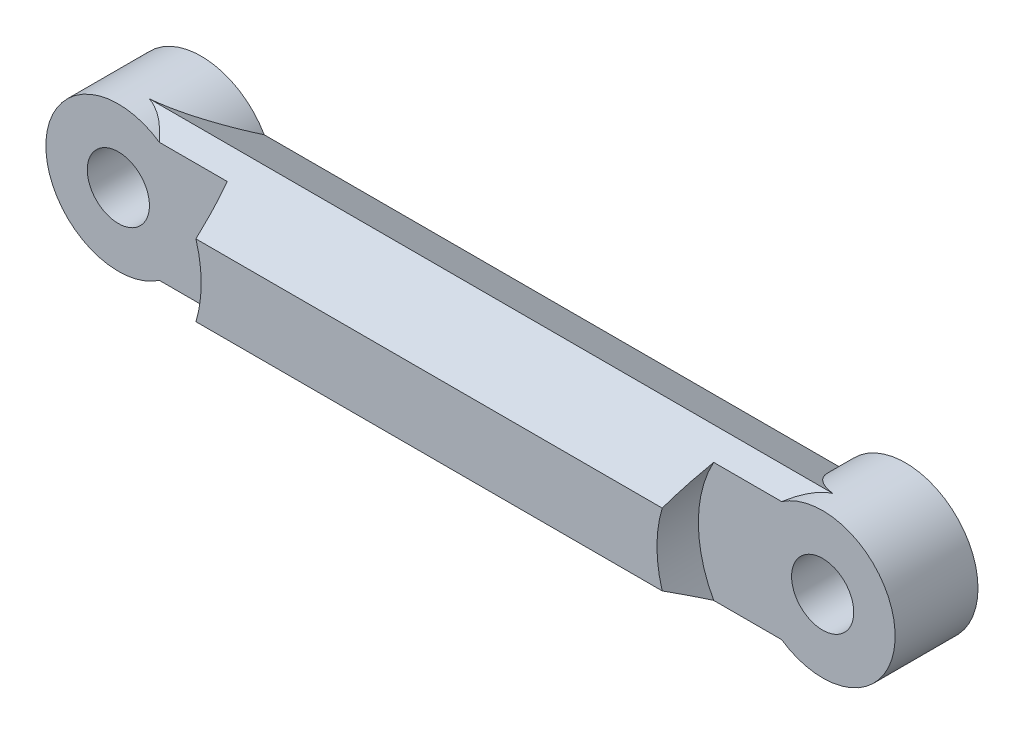
ISO-10303-21;
HEADER;
FILE_DESCRIPTION(('STEP AP214'),'2;1');
FILE_NAME('part.step','',(''),(''),'','','');
FILE_SCHEMA(('AUTOMOTIVE_DESIGN { 1 0 10303 214 1 1 1 1 }'));
ENDSEC;
DATA;
#1=APPLICATION_CONTEXT('core data for automotive mechanical design processes');
#2=APPLICATION_PROTOCOL_DEFINITION('international standard','automotive_design',2000,#1);
#3=PRODUCT_CONTEXT('',#1,'mechanical');
#4=PRODUCT('Part','Part','',(#3));
#5=PRODUCT_RELATED_PRODUCT_CATEGORY('part','',(#4));
#6=PRODUCT_DEFINITION_FORMATION('','',#4);
#7=PRODUCT_DEFINITION_CONTEXT('part definition',#1,'design');
#8=PRODUCT_DEFINITION('design','',#6,#7);
#9=PRODUCT_DEFINITION_SHAPE('','',#8);
#10=(LENGTH_UNIT() NAMED_UNIT(*) SI_UNIT(.MILLI.,.METRE.));
#11=(NAMED_UNIT(*) PLANE_ANGLE_UNIT() SI_UNIT($,.RADIAN.));
#12=(NAMED_UNIT(*) SI_UNIT($,.STERADIAN.) SOLID_ANGLE_UNIT());
#13=UNCERTAINTY_MEASURE_WITH_UNIT(LENGTH_MEASURE(1.E-05),#10,'distance_accuracy_value','');
#14=(GEOMETRIC_REPRESENTATION_CONTEXT(3) GLOBAL_UNCERTAINTY_ASSIGNED_CONTEXT((#13)) GLOBAL_UNIT_ASSIGNED_CONTEXT((#10,
#11,#12)) REPRESENTATION_CONTEXT('',''));
#15=CARTESIAN_POINT('',(0.,0.,0.));
#16=DIRECTION('',(0.,0.,1.));
#17=DIRECTION('',(1.,0.,0.));
#18=AXIS2_PLACEMENT_3D('',#15,#16,#17);
#19=CARTESIAN_POINT('',(-17.,0.,3.));
#20=DIRECTION('',(0.,0.,-1.));
#21=DIRECTION('',(-1.,0.,0.));
#22=AXIS2_PLACEMENT_3D('',#19,#20,#21);
#23=CYLINDRICAL_SURFACE('',#22,3.5);
#24=CARTESIAN_POINT('',(-17.,0.,1.));
#25=DIRECTION('',(0.,0.,1.));
#26=DIRECTION('',(1.,0.,0.));
#27=AXIS2_PLACEMENT_3D('',#24,#25,#26);
#28=CIRCLE('',#27,3.5);
#29=CARTESIAN_POINT('',(-15.0209429854937,2.88675134594813,1.));
#30=VERTEX_POINT('',#29);
#31=CARTESIAN_POINT('',(-15.0209429854937,-2.88675134594813,1.));
#32=VERTEX_POINT('',#31);
#33=EDGE_CURVE('E129',#30,#32,#28,.T.);
#34=ORIENTED_EDGE('',*,*,#33,.F.);
#35=CARTESIAN_POINT('',(-17.,0.,6.));
#36=DIRECTION('',(0.,0.866025403784439,0.5));
#37=DIRECTION('',(0.,0.5,-0.866025403784439));
#38=AXIS2_PLACEMENT_3D('',#35,#36,#37);
#39=ELLIPSE('',#38,7.,3.5);
#40=CARTESIAN_POINT('',(-16.5,3.46410161513775,0.));
#41=VERTEX_POINT('',#40);
#42=EDGE_CURVE('E162',#41,#30,#39,.F.);
#43=ORIENTED_EDGE('',*,*,#42,.F.);
#44=CARTESIAN_POINT('',(-17.,0.,-6.));
#45=DIRECTION('',(0.,0.866025403784439,-0.5));
#46=DIRECTION('',(0.,-0.5,-0.866025403784439));
#47=AXIS2_PLACEMENT_3D('',#44,#45,#46);
#48=ELLIPSE('',#47,7.,3.5);
#49=CARTESIAN_POINT('',(-13.9586187348509,1.73205080756888,-3.));
#50=VERTEX_POINT('',#49);
#51=EDGE_CURVE('E197',#50,#41,#48,.F.);
#52=ORIENTED_EDGE('',*,*,#51,.F.);
#53=CARTESIAN_POINT('',(-17.,0.,-3.));
#54=DIRECTION('',(0.,0.,1.));
#55=DIRECTION('',(1.,0.,0.));
#56=AXIS2_PLACEMENT_3D('',#53,#54,#55);
#57=CIRCLE('',#56,3.5);
#58=CARTESIAN_POINT('',(-13.9586187348509,-1.73205080756888,-3.));
#59=VERTEX_POINT('',#58);
#60=EDGE_CURVE('E147',#50,#59,#57,.T.);
#61=ORIENTED_EDGE('',*,*,#60,.T.);
#62=CARTESIAN_POINT('',(-17.,0.,-6.));
#63=DIRECTION('',(0.,-0.866025403784439,-0.5));
#64=DIRECTION('',(0.,0.5,-0.866025403784439));
#65=AXIS2_PLACEMENT_3D('',#62,#63,#64);
#66=ELLIPSE('',#65,7.,3.5);
#67=CARTESIAN_POINT('',(-16.5,-3.46410161513775,0.));
#68=VERTEX_POINT('',#67);
#69=EDGE_CURVE('E204',#68,#59,#66,.F.);
#70=ORIENTED_EDGE('',*,*,#69,.F.);
#71=CARTESIAN_POINT('',(-17.,0.,6.));
#72=DIRECTION('',(0.,-0.866025403784439,0.5));
#73=DIRECTION('',(0.,-0.5,-0.866025403784439));
#74=AXIS2_PLACEMENT_3D('',#71,#72,#73);
#75=ELLIPSE('',#74,7.,3.5);
#76=EDGE_CURVE('E134',#32,#68,#75,.F.);
#77=ORIENTED_EDGE('',*,*,#76,.F.);
#78=EDGE_LOOP('',(#34,#43,#52,#61,#70,#77));
#79=FACE_BOUND('',#78,.T.);
#80=ADVANCED_FACE('F35',(#79),#23,.T.);
#81=CARTESIAN_POINT('',(-17.,0.,3.));
#82=DIRECTION('',(0.,0.,-1.));
#83=DIRECTION('',(-1.,0.,0.));
#84=AXIS2_PLACEMENT_3D('',#81,#82,#83);
#85=CYLINDRICAL_SURFACE('',#84,1.5);
#86=CARTESIAN_POINT('',(-17.,0.,-3.));
#87=DIRECTION('',(0.,0.,1.));
#88=DIRECTION('',(1.,0.,0.));
#89=AXIS2_PLACEMENT_3D('',#86,#87,#88);
#90=CIRCLE('',#89,1.5);
#91=CARTESIAN_POINT('',(-15.5,0.,-3.));
#92=VERTEX_POINT('',#91);
#93=EDGE_CURVE('E144',#92,#92,#90,.T.);
#94=ORIENTED_EDGE('',*,*,#93,.F.);
#95=EDGE_LOOP('',(#94));
#96=FACE_BOUND('',#95,.T.);
#97=CARTESIAN_POINT('',(-17.,0.,1.));
#98=DIRECTION('',(0.,0.,1.));
#99=DIRECTION('',(1.,0.,0.));
#100=AXIS2_PLACEMENT_3D('',#97,#98,#99);
#101=CIRCLE('',#100,1.5);
#102=CARTESIAN_POINT('',(-15.5,0.,1.));
#103=VERTEX_POINT('',#102);
#104=EDGE_CURVE('E172',#103,#103,#101,.T.);
#105=ORIENTED_EDGE('',*,*,#104,.T.);
#106=EDGE_LOOP('',(#105));
#107=FACE_BOUND('',#106,.T.);
#108=ADVANCED_FACE('F241',(#96,#107),#85,.F.);
#109=CARTESIAN_POINT('',(-17.,0.,3.));
#110=DIRECTION('',(0.,0.,1.));
#111=DIRECTION('',(1.,0.,0.));
#112=AXIS2_PLACEMENT_3D('',#109,#110,#111);
#113=PLANE('',#112);
#114=CARTESIAN_POINT('',(-17.,0.,3.));
#115=DIRECTION('',(0.,0.,1.));
#116=DIRECTION('',(1.,0.,0.));
#117=AXIS2_PLACEMENT_3D('',#114,#115,#116);
#118=CIRCLE('',#117,6.);
#119=CARTESIAN_POINT('',(-11.255437353462,-1.73205080756888,3.));
#120=VERTEX_POINT('',#119);
#121=CARTESIAN_POINT('',(-11.255437353462,1.73205080756888,3.));
#122=VERTEX_POINT('',#121);
#123=EDGE_CURVE('E133',#120,#122,#118,.T.);
#124=ORIENTED_EDGE('',*,*,#123,.F.);
#125=DIRECTION('',(1.,0.,0.));
#126=VECTOR('',#125,1.);
#127=CARTESIAN_POINT('',(-20.501,-1.73205080756888,3.));
#128=LINE('',#127,#126);
#129=CARTESIAN_POINT('',(11.255437353462,-1.73205080756888,3.));
#130=VERTEX_POINT('',#129);
#131=EDGE_CURVE('E127',#120,#130,#128,.T.);
#132=ORIENTED_EDGE('',*,*,#131,.T.);
#133=CARTESIAN_POINT('',(17.,0.,3.));
#134=DIRECTION('',(0.,0.,1.));
#135=DIRECTION('',(-1.,0.,0.));
#136=AXIS2_PLACEMENT_3D('',#133,#134,#135);
#137=CIRCLE('',#136,6.);
#138=CARTESIAN_POINT('',(11.255437353462,1.73205080756888,3.));
#139=VERTEX_POINT('',#138);
#140=EDGE_CURVE('E110',#139,#130,#137,.T.);
#141=ORIENTED_EDGE('',*,*,#140,.F.);
#142=DIRECTION('',(1.,0.,0.));
#143=VECTOR('',#142,1.);
#144=CARTESIAN_POINT('',(-20.501,1.73205080756888,3.));
#145=LINE('',#144,#143);
#146=EDGE_CURVE('E148',#122,#139,#145,.T.);
#147=ORIENTED_EDGE('',*,*,#146,.F.);
#148=EDGE_LOOP('',(#124,#132,#141,#147));
#149=FACE_BOUND('',#148,.T.);
#150=ADVANCED_FACE('F132',(#149),#113,.T.);
#151=CARTESIAN_POINT('',(-17.,0.,-3.));
#152=DIRECTION('',(0.,0.,1.));
#153=DIRECTION('',(1.,0.,0.));
#154=AXIS2_PLACEMENT_3D('',#151,#152,#153);
#155=PLANE('',#154);
#156=ORIENTED_EDGE('',*,*,#60,.F.);
#157=DIRECTION('',(1.,0.,0.));
#158=VECTOR('',#157,1.);
#159=CARTESIAN_POINT('',(-20.501,1.73205080756888,-3.));
#160=LINE('',#159,#158);
#161=CARTESIAN_POINT('',(13.9586187348509,1.73205080756888,-3.));
#162=VERTEX_POINT('',#161);
#163=EDGE_CURVE('E199',#50,#162,#160,.T.);
#164=ORIENTED_EDGE('',*,*,#163,.T.);
#165=CARTESIAN_POINT('',(17.,0.,-3.));
#166=DIRECTION('',(0.,0.,1.));
#167=DIRECTION('',(1.,0.,0.));
#168=AXIS2_PLACEMENT_3D('',#165,#166,#167);
#169=CIRCLE('',#168,3.5);
#170=CARTESIAN_POINT('',(13.9586187348509,-1.73205080756888,-3.));
#171=VERTEX_POINT('',#170);
#172=EDGE_CURVE('E183',#171,#162,#169,.T.);
#173=ORIENTED_EDGE('',*,*,#172,.F.);
#174=DIRECTION('',(1.,0.,0.));
#175=VECTOR('',#174,1.);
#176=CARTESIAN_POINT('',(-20.501,-1.73205080756888,-3.));
#177=LINE('',#176,#175);
#178=EDGE_CURVE('E202',#59,#171,#177,.T.);
#179=ORIENTED_EDGE('',*,*,#178,.F.);
#180=EDGE_LOOP('',(#156,#164,#173,#179));
#181=FACE_BOUND('',#180,.T.);
#182=ORIENTED_EDGE('',*,*,#93,.T.);
#183=EDGE_LOOP('',(#182));
#184=FACE_BOUND('',#183,.T.);
#185=CARTESIAN_POINT('',(17.,0.,-3.));
#186=DIRECTION('',(0.,0.,1.));
#187=DIRECTION('',(1.,0.,0.));
#188=AXIS2_PLACEMENT_3D('',#185,#186,#187);
#189=CIRCLE('',#188,1.5);
#190=CARTESIAN_POINT('',(18.5,0.,-3.));
#191=VERTEX_POINT('',#190);
#192=EDGE_CURVE('E180',#191,#191,#189,.T.);
#193=ORIENTED_EDGE('',*,*,#192,.T.);
#194=EDGE_LOOP('',(#193));
#195=FACE_BOUND('',#194,.T.);
#196=ADVANCED_FACE('F216',(#181,#184,#195),#155,.F.);
#197=CARTESIAN_POINT('',(-20.501,-1.73205080756888,3.));
#198=DIRECTION('',(0.,-0.866025403784439,0.5));
#199=DIRECTION('',(0.,-0.5,-0.866025403784439));
#200=AXIS2_PLACEMENT_3D('',#197,#198,#199);
#201=PLANE('',#200);
#202=CARTESIAN_POINT('',(-17.,0.,6.));
#203=DIRECTION('',(0.,-0.866025403784439,0.5));
#204=DIRECTION('',(0.,0.5,0.866025403784439));
#205=AXIS2_PLACEMENT_3D('',#202,#203,#204);
#206=ELLIPSE('',#205,12.,6.);
#207=CARTESIAN_POINT('',(-11.7400887206468,-2.88675134594813,1.));
#208=VERTEX_POINT('',#207);
#209=EDGE_CURVE('E178',#208,#120,#206,.T.);
#210=ORIENTED_EDGE('',*,*,#209,.F.);
#211=DIRECTION('',(-1.,0.,0.));
#212=VECTOR('',#211,1.);
#213=CARTESIAN_POINT('',(-20.501,-2.88675134594813,1.));
#214=LINE('',#213,#212);
#215=EDGE_CURVE('E170',#208,#32,#214,.T.);
#216=ORIENTED_EDGE('',*,*,#215,.T.);
#217=ORIENTED_EDGE('',*,*,#76,.T.);
#218=DIRECTION('',(1.,0.,0.));
#219=VECTOR('',#218,1.);
#220=CARTESIAN_POINT('',(-20.501,-3.46410161513775,0.));
#221=LINE('',#220,#219);
#222=CARTESIAN_POINT('',(16.5,-3.46410161513775,0.));
#223=VERTEX_POINT('',#222);
#224=EDGE_CURVE('E137',#68,#223,#221,.T.);
#225=ORIENTED_EDGE('',*,*,#224,.T.);
#226=CARTESIAN_POINT('',(17.,0.,6.));
#227=DIRECTION('',(0.,0.866025403784438,-0.5));
#228=DIRECTION('',(0.,-0.5,-0.866025403784439));
#229=AXIS2_PLACEMENT_3D('',#226,#227,#228);
#230=ELLIPSE('',#229,7.00000000000001,3.5);
#231=CARTESIAN_POINT('',(15.0209429854937,-2.88675134594813,1.));
#232=VERTEX_POINT('',#231);
#233=EDGE_CURVE('E185',#232,#223,#230,.F.);
#234=ORIENTED_EDGE('',*,*,#233,.F.);
#235=DIRECTION('',(1.,0.,0.));
#236=VECTOR('',#235,1.);
#237=CARTESIAN_POINT('',(-20.501,-2.88675134594813,1.));
#238=LINE('',#237,#236);
#239=CARTESIAN_POINT('',(11.7400887206468,-2.88675134594813,1.));
#240=VERTEX_POINT('',#239);
#241=EDGE_CURVE('E56',#240,#232,#238,.T.);
#242=ORIENTED_EDGE('',*,*,#241,.F.);
#243=CARTESIAN_POINT('',(17.,0.,6.));
#244=DIRECTION('',(0.,-0.866025403784439,0.5));
#245=DIRECTION('',(0.,0.5,0.866025403784439));
#246=AXIS2_PLACEMENT_3D('',#243,#244,#245);
#247=ELLIPSE('',#246,12.,6.);
#248=EDGE_CURVE('E114',#130,#240,#247,.T.);
#249=ORIENTED_EDGE('',*,*,#248,.F.);
#250=ORIENTED_EDGE('',*,*,#131,.F.);
#251=EDGE_LOOP('',(#210,#216,#217,#225,#234,#242,#249,#250));
#252=FACE_BOUND('',#251,.T.);
#253=ADVANCED_FACE('F126',(#252),#201,.T.);
#254=CARTESIAN_POINT('',(-20.501,-3.46410161513775,0.));
#255=DIRECTION('',(0.,-0.866025403784439,-0.5));
#256=DIRECTION('',(0.,0.5,-0.866025403784439));
#257=AXIS2_PLACEMENT_3D('',#254,#255,#256);
#258=PLANE('',#257);
#259=ORIENTED_EDGE('',*,*,#224,.F.);
#260=ORIENTED_EDGE('',*,*,#69,.T.);
#261=ORIENTED_EDGE('',*,*,#178,.T.);
#262=CARTESIAN_POINT('',(17.,0.,-6.));
#263=DIRECTION('',(0.,0.866025403784438,0.5));
#264=DIRECTION('',(0.,0.5,-0.866025403784439));
#265=AXIS2_PLACEMENT_3D('',#262,#263,#264);
#266=ELLIPSE('',#265,7.00000000000001,3.5);
#267=EDGE_CURVE('E188',#223,#171,#266,.F.);
#268=ORIENTED_EDGE('',*,*,#267,.F.);
#269=EDGE_LOOP('',(#259,#260,#261,#268));
#270=FACE_BOUND('',#269,.T.);
#271=ADVANCED_FACE('F210',(#270),#258,.T.);
#272=CARTESIAN_POINT('',(-20.501,1.73205080756888,-3.));
#273=DIRECTION('',(0.,0.866025403784439,-0.5));
#274=DIRECTION('',(0.,0.5,0.866025403784439));
#275=AXIS2_PLACEMENT_3D('',#272,#273,#274);
#276=PLANE('',#275);
#277=ORIENTED_EDGE('',*,*,#163,.F.);
#278=ORIENTED_EDGE('',*,*,#51,.T.);
#279=DIRECTION('',(1.,0.,0.));
#280=VECTOR('',#279,1.);
#281=CARTESIAN_POINT('',(-20.501,3.46410161513775,0.));
#282=LINE('',#281,#280);
#283=CARTESIAN_POINT('',(16.5,3.46410161513775,0.));
#284=VERTEX_POINT('',#283);
#285=EDGE_CURVE('E195',#41,#284,#282,.T.);
#286=ORIENTED_EDGE('',*,*,#285,.T.);
#287=CARTESIAN_POINT('',(17.,0.,-6.));
#288=DIRECTION('',(0.,-0.866025403784438,0.5));
#289=DIRECTION('',(0.,-0.5,-0.866025403784439));
#290=AXIS2_PLACEMENT_3D('',#287,#288,#289);
#291=ELLIPSE('',#290,7.00000000000001,3.5);
#292=EDGE_CURVE('E140',#162,#284,#291,.F.);
#293=ORIENTED_EDGE('',*,*,#292,.F.);
#294=EDGE_LOOP('',(#277,#278,#286,#293));
#295=FACE_BOUND('',#294,.T.);
#296=ADVANCED_FACE('F219',(#295),#276,.T.);
#297=CARTESIAN_POINT('',(-20.501,3.46410161513775,0.));
#298=DIRECTION('',(0.,0.866025403784439,0.5));
#299=DIRECTION('',(0.,-0.5,0.866025403784439));
#300=AXIS2_PLACEMENT_3D('',#297,#298,#299);
#301=PLANE('',#300);
#302=CARTESIAN_POINT('',(-17.,0.,6.));
#303=DIRECTION('',(0.,0.866025403784439,0.5));
#304=DIRECTION('',(0.,-0.5,0.866025403784439));
#305=AXIS2_PLACEMENT_3D('',#302,#303,#304);
#306=ELLIPSE('',#305,12.,6.);
#307=CARTESIAN_POINT('',(-11.7400887206468,2.88675134594813,1.));
#308=VERTEX_POINT('',#307);
#309=EDGE_CURVE('E11',#122,#308,#306,.T.);
#310=ORIENTED_EDGE('',*,*,#309,.F.);
#311=ORIENTED_EDGE('',*,*,#146,.T.);
#312=CARTESIAN_POINT('',(17.,0.,6.));
#313=DIRECTION('',(0.,0.866025403784439,0.5));
#314=DIRECTION('',(0.,-0.5,0.866025403784439));
#315=AXIS2_PLACEMENT_3D('',#312,#313,#314);
#316=ELLIPSE('',#315,12.,6.);
#317=CARTESIAN_POINT('',(11.7400887206468,2.88675134594813,1.));
#318=VERTEX_POINT('',#317);
#319=EDGE_CURVE('E116',#318,#139,#316,.T.);
#320=ORIENTED_EDGE('',*,*,#319,.F.);
#321=DIRECTION('',(-1.,0.,0.));
#322=VECTOR('',#321,1.);
#323=CARTESIAN_POINT('',(-20.501,2.88675134594813,1.));
#324=LINE('',#323,#322);
#325=CARTESIAN_POINT('',(15.0209429854937,2.88675134594813,1.));
#326=VERTEX_POINT('',#325);
#327=EDGE_CURVE('E222',#326,#318,#324,.T.);
#328=ORIENTED_EDGE('',*,*,#327,.F.);
#329=CARTESIAN_POINT('',(17.,0.,6.));
#330=DIRECTION('',(0.,-0.866025403784438,-0.5));
#331=DIRECTION('',(0.,0.5,-0.866025403784439));
#332=AXIS2_PLACEMENT_3D('',#329,#330,#331);
#333=ELLIPSE('',#332,7.00000000000001,3.5);
#334=EDGE_CURVE('E135',#284,#326,#333,.F.);
#335=ORIENTED_EDGE('',*,*,#334,.F.);
#336=ORIENTED_EDGE('',*,*,#285,.F.);
#337=ORIENTED_EDGE('',*,*,#42,.T.);
#338=DIRECTION('',(1.,0.,0.));
#339=VECTOR('',#338,1.);
#340=CARTESIAN_POINT('',(-20.501,2.88675134594813,1.));
#341=LINE('',#340,#339);
#342=EDGE_CURVE('E42',#30,#308,#341,.T.);
#343=ORIENTED_EDGE('',*,*,#342,.T.);
#344=EDGE_LOOP('',(#310,#311,#320,#328,#335,#336,#337,#343));
#345=FACE_BOUND('',#344,.T.);
#346=ADVANCED_FACE('F159',(#345),#301,.T.);
#347=CARTESIAN_POINT('',(17.,0.,3.));
#348=DIRECTION('',(0.,0.,-1.));
#349=DIRECTION('',(-1.,0.,0.));
#350=AXIS2_PLACEMENT_3D('',#347,#348,#349);
#351=CYLINDRICAL_SURFACE('',#350,3.5);
#352=ORIENTED_EDGE('',*,*,#334,.T.);
#353=CARTESIAN_POINT('',(17.,0.,1.));
#354=DIRECTION('',(0.,0.,-1.));
#355=DIRECTION('',(-1.,0.,0.));
#356=AXIS2_PLACEMENT_3D('',#353,#354,#355);
#357=CIRCLE('',#356,3.5);
#358=EDGE_CURVE('E154',#326,#232,#357,.T.);
#359=ORIENTED_EDGE('',*,*,#358,.T.);
#360=ORIENTED_EDGE('',*,*,#233,.T.);
#361=ORIENTED_EDGE('',*,*,#267,.T.);
#362=ORIENTED_EDGE('',*,*,#172,.T.);
#363=ORIENTED_EDGE('',*,*,#292,.T.);
#364=EDGE_LOOP('',(#352,#359,#360,#361,#362,#363));
#365=FACE_BOUND('',#364,.T.);
#366=ADVANCED_FACE('F213',(#365),#351,.T.);
#367=CARTESIAN_POINT('',(17.,0.,3.));
#368=DIRECTION('',(0.,0.,-1.));
#369=DIRECTION('',(-1.,0.,0.));
#370=AXIS2_PLACEMENT_3D('',#367,#368,#369);
#371=CYLINDRICAL_SURFACE('',#370,1.5);
#372=CARTESIAN_POINT('',(17.,0.,1.));
#373=DIRECTION('',(0.,0.,-1.));
#374=DIRECTION('',(-1.,0.,0.));
#375=AXIS2_PLACEMENT_3D('',#372,#373,#374);
#376=CIRCLE('',#375,1.5);
#377=CARTESIAN_POINT('',(15.5,0.,1.));
#378=VERTEX_POINT('',#377);
#379=EDGE_CURVE('E151',#378,#378,#376,.T.);
#380=ORIENTED_EDGE('',*,*,#379,.F.);
#381=EDGE_LOOP('',(#380));
#382=FACE_BOUND('',#381,.T.);
#383=ORIENTED_EDGE('',*,*,#192,.F.);
#384=EDGE_LOOP('',(#383));
#385=FACE_BOUND('',#384,.T.);
#386=ADVANCED_FACE('F269',(#382,#385),#371,.F.);
#387=CARTESIAN_POINT('',(17.,0.,1.));
#388=DIRECTION('',(0.,0.,1.));
#389=DIRECTION('',(1.,0.,0.));
#390=AXIS2_PLACEMENT_3D('',#387,#388,#389);
#391=CYLINDRICAL_SURFACE('',#390,6.);
#392=ORIENTED_EDGE('',*,*,#248,.T.);
#393=CARTESIAN_POINT('',(17.,0.,1.));
#394=DIRECTION('',(0.,0.,1.));
#395=DIRECTION('',(-1.,0.,0.));
#396=AXIS2_PLACEMENT_3D('',#393,#394,#395);
#397=CIRCLE('',#396,6.);
#398=EDGE_CURVE('E121',#318,#240,#397,.T.);
#399=ORIENTED_EDGE('',*,*,#398,.F.);
#400=ORIENTED_EDGE('',*,*,#319,.T.);
#401=ORIENTED_EDGE('',*,*,#140,.T.);
#402=EDGE_LOOP('',(#392,#399,#400,#401));
#403=FACE_BOUND('',#402,.T.);
#404=ADVANCED_FACE('F112',(#403),#391,.F.);
#405=CARTESIAN_POINT('',(17.,0.,1.));
#406=DIRECTION('',(0.,0.,-1.));
#407=DIRECTION('',(-1.,0.,0.));
#408=AXIS2_PLACEMENT_3D('',#405,#406,#407);
#409=PLANE('',#408);
#410=ORIENTED_EDGE('',*,*,#241,.T.);
#411=ORIENTED_EDGE('',*,*,#358,.F.);
#412=ORIENTED_EDGE('',*,*,#327,.T.);
#413=ORIENTED_EDGE('',*,*,#398,.T.);
#414=EDGE_LOOP('',(#410,#411,#412,#413));
#415=FACE_BOUND('',#414,.T.);
#416=ORIENTED_EDGE('',*,*,#379,.T.);
#417=EDGE_LOOP('',(#416));
#418=FACE_BOUND('',#417,.T.);
#419=ADVANCED_FACE('F231',(#415,#418),#409,.F.);
#420=CARTESIAN_POINT('',(-17.,0.,1.));
#421=DIRECTION('',(0.,0.,1.));
#422=DIRECTION('',(1.,0.,0.));
#423=AXIS2_PLACEMENT_3D('',#420,#421,#422);
#424=CYLINDRICAL_SURFACE('',#423,6.);
#425=ORIENTED_EDGE('',*,*,#209,.T.);
#426=ORIENTED_EDGE('',*,*,#123,.T.);
#427=ORIENTED_EDGE('',*,*,#309,.T.);
#428=CARTESIAN_POINT('',(-17.,0.,1.));
#429=DIRECTION('',(0.,0.,1.));
#430=DIRECTION('',(1.,0.,0.));
#431=AXIS2_PLACEMENT_3D('',#428,#429,#430);
#432=CIRCLE('',#431,6.);
#433=EDGE_CURVE('E49',#208,#308,#432,.T.);
#434=ORIENTED_EDGE('',*,*,#433,.F.);
#435=EDGE_LOOP('',(#425,#426,#427,#434));
#436=FACE_BOUND('',#435,.T.);
#437=ADVANCED_FACE('F229',(#436),#424,.F.);
#438=CARTESIAN_POINT('',(-17.,0.,1.));
#439=DIRECTION('',(0.,0.,1.));
#440=DIRECTION('',(1.,0.,0.));
#441=AXIS2_PLACEMENT_3D('',#438,#439,#440);
#442=PLANE('',#441);
#443=ORIENTED_EDGE('',*,*,#104,.F.);
#444=EDGE_LOOP('',(#443));
#445=FACE_BOUND('',#444,.T.);
#446=ORIENTED_EDGE('',*,*,#433,.T.);
#447=ORIENTED_EDGE('',*,*,#342,.F.);
#448=ORIENTED_EDGE('',*,*,#33,.T.);
#449=ORIENTED_EDGE('',*,*,#215,.F.);
#450=EDGE_LOOP('',(#446,#447,#448,#449));
#451=FACE_BOUND('',#450,.T.);
#452=ADVANCED_FACE('F164',(#445,#451),#442,.T.);
#453=CLOSED_SHELL('',(#80,#108,#150,#196,#253,#271,#296,#346,#366,#386,#404,#419,#437,#452));
#454=MANIFOLD_SOLID_BREP('B2',#453);
#455=ADVANCED_BREP_SHAPE_REPRESENTATION('',(#18,#454),#14);
#456=SHAPE_DEFINITION_REPRESENTATION(#9,#455);
ENDSEC;
END-ISO-10303-21;
